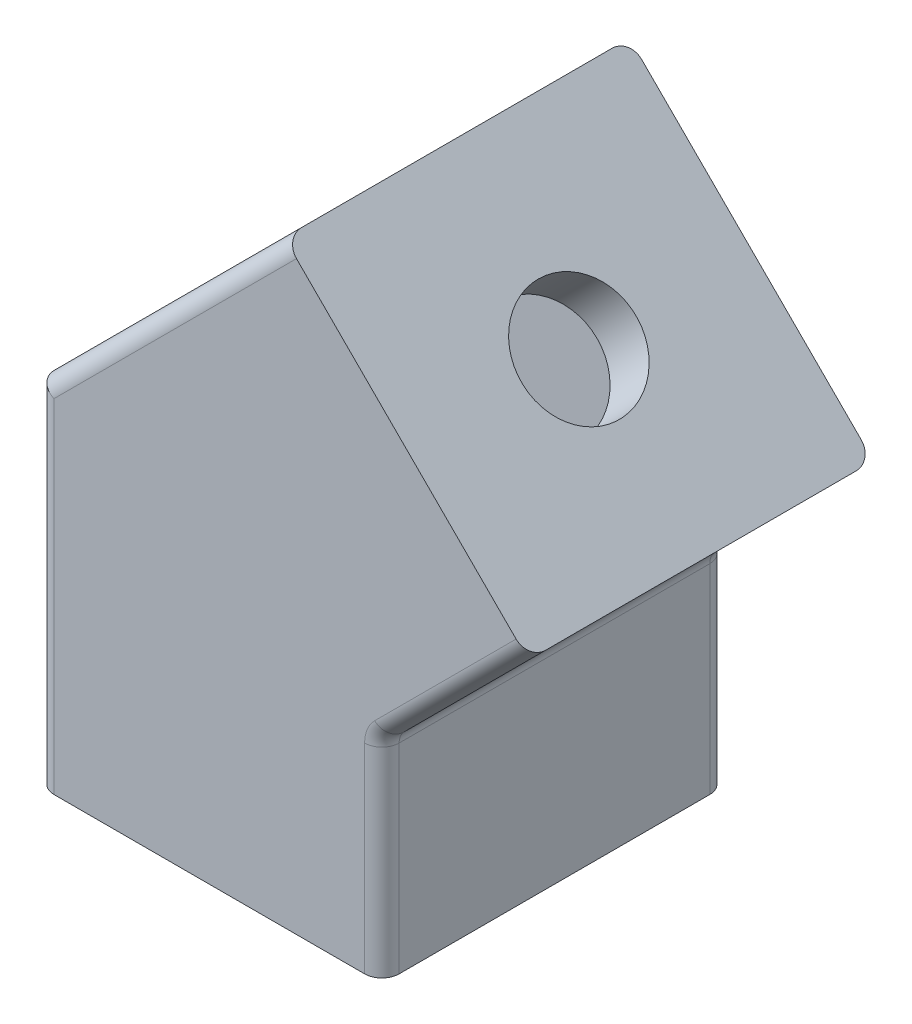
ISO-10303-21;
HEADER;
FILE_DESCRIPTION(('STEP AP214'),'2;1');
FILE_NAME('part.step','',(''),(''),'','','');
FILE_SCHEMA(('AUTOMOTIVE_DESIGN { 1 0 10303 214 1 1 1 1 }'));
ENDSEC;
DATA;
#1=APPLICATION_CONTEXT('core data for automotive mechanical design processes');
#2=APPLICATION_PROTOCOL_DEFINITION('international standard','automotive_design',2000,#1);
#3=PRODUCT_CONTEXT('',#1,'mechanical');
#4=PRODUCT('Part','Part','',(#3));
#5=PRODUCT_RELATED_PRODUCT_CATEGORY('part','',(#4));
#6=PRODUCT_DEFINITION_FORMATION('','',#4);
#7=PRODUCT_DEFINITION_CONTEXT('part definition',#1,'design');
#8=PRODUCT_DEFINITION('design','',#6,#7);
#9=PRODUCT_DEFINITION_SHAPE('','',#8);
#10=(LENGTH_UNIT() NAMED_UNIT(*) SI_UNIT(.MILLI.,.METRE.));
#11=(NAMED_UNIT(*) PLANE_ANGLE_UNIT() SI_UNIT($,.RADIAN.));
#12=(NAMED_UNIT(*) SI_UNIT($,.STERADIAN.) SOLID_ANGLE_UNIT());
#13=UNCERTAINTY_MEASURE_WITH_UNIT(LENGTH_MEASURE(1.E-05),#10,'distance_accuracy_value','');
#14=(GEOMETRIC_REPRESENTATION_CONTEXT(3) GLOBAL_UNCERTAINTY_ASSIGNED_CONTEXT((#13)) GLOBAL_UNIT_ASSIGNED_CONTEXT((#10,
#11,#12)) REPRESENTATION_CONTEXT('',''));
#15=CARTESIAN_POINT('',(0.,0.,0.));
#16=DIRECTION('',(0.,0.,1.));
#17=DIRECTION('',(1.,0.,0.));
#18=AXIS2_PLACEMENT_3D('',#15,#16,#17);
#19=CARTESIAN_POINT('',(-11.3137084989846,45.2548339959391,20.));
#20=DIRECTION('',(0.707106781186546,-0.707106781186549,0.));
#21=DIRECTION('',(0.707106781186549,0.707106781186546,0.));
#22=AXIS2_PLACEMENT_3D('',#19,#20,#21);
#23=PLANE('',#22);
#24=DIRECTION('',(0.,0.,-1.));
#25=VECTOR('',#24,1.);
#26=CARTESIAN_POINT('',(-40.,16.5685424949239,20.));
#27=LINE('',#26,#25);
#28=CARTESIAN_POINT('',(-40.,16.5685424949239,18.));
#29=VERTEX_POINT('',#28);
#30=CARTESIAN_POINT('',(-40.,16.5685424949239,16.7));
#31=VERTEX_POINT('',#30);
#32=EDGE_CURVE('E256',#29,#31,#27,.T.);
#33=ORIENTED_EDGE('',*,*,#32,.F.);
#34=DIRECTION('',(-0.707106781186549,-0.707106781186546,0.));
#35=VECTOR('',#34,1.);
#36=CARTESIAN_POINT('',(-11.3137084989846,45.2548339959391,18.));
#37=LINE('',#36,#35);
#38=CARTESIAN_POINT('',(-11.3137084989846,45.2548339959391,18.));
#39=VERTEX_POINT('',#38);
#40=EDGE_CURVE('E310',#29,#39,#37,.F.);
#41=ORIENTED_EDGE('',*,*,#40,.T.);
#42=DIRECTION('',(0.,0.,-1.));
#43=VECTOR('',#42,1.);
#44=CARTESIAN_POINT('',(-11.3137084989846,45.2548339959391,20.));
#45=LINE('',#44,#43);
#46=CARTESIAN_POINT('',(-11.3137084989846,45.2548339959391,-18.));
#47=VERTEX_POINT('',#46);
#48=EDGE_CURVE('E258',#39,#47,#45,.T.);
#49=ORIENTED_EDGE('',*,*,#48,.T.);
#50=DIRECTION('',(-0.707106781186549,-0.707106781186546,0.));
#51=VECTOR('',#50,1.);
#52=CARTESIAN_POINT('',(-11.3137084989846,45.2548339959391,-18.));
#53=LINE('',#52,#51);
#54=CARTESIAN_POINT('',(-40.,16.5685424949239,-18.));
#55=VERTEX_POINT('',#54);
#56=EDGE_CURVE('E307',#47,#55,#53,.T.);
#57=ORIENTED_EDGE('',*,*,#56,.T.);
#58=CARTESIAN_POINT('',(-40.,16.5685424949239,-16.7));
#59=VERTEX_POINT('',#58);
#60=EDGE_CURVE('E255',#59,#55,#27,.T.);
#61=ORIENTED_EDGE('',*,*,#60,.F.);
#62=DIRECTION('',(-0.707106781186549,-0.707106781186546,0.));
#63=VECTOR('',#62,1.);
#64=CARTESIAN_POINT('',(-11.3137084989846,45.2548339959391,-16.7));
#65=LINE('',#64,#63);
#66=CARTESIAN_POINT('',(-15.8391918985786,40.7293505963452,-16.7));
#67=VERTEX_POINT('',#66);
#68=EDGE_CURVE('E227',#67,#59,#65,.T.);
#69=ORIENTED_EDGE('',*,*,#68,.F.);
#70=DIRECTION('',(0.,0.,-1.));
#71=VECTOR('',#70,1.);
#72=CARTESIAN_POINT('',(-15.8391918985786,40.7293505963452,20.));
#73=LINE('',#72,#71);
#74=CARTESIAN_POINT('',(-15.8391918985786,40.7293505963452,16.7));
#75=VERTEX_POINT('',#74);
#76=EDGE_CURVE('E223',#75,#67,#73,.T.);
#77=ORIENTED_EDGE('',*,*,#76,.F.);
#78=DIRECTION('',(-0.707106781186549,-0.707106781186546,0.));
#79=VECTOR('',#78,1.);
#80=CARTESIAN_POINT('',(-11.3137084989846,45.2548339959391,16.7));
#81=LINE('',#80,#79);
#82=EDGE_CURVE('E229',#75,#31,#81,.T.);
#83=ORIENTED_EDGE('',*,*,#82,.T.);
#84=EDGE_LOOP('',(#33,#41,#49,#57,#61,#69,#77,#83));
#85=FACE_BOUND('',#84,.T.);
#86=ADVANCED_FACE('F39',(#85),#23,.F.);
#87=CARTESIAN_POINT('',(-40.,16.5685424949239,20.));
#88=DIRECTION('',(1.,0.,0.));
#89=DIRECTION('',(0.,0.,-1.));
#90=AXIS2_PLACEMENT_3D('',#87,#88,#89);
#91=PLANE('',#90);
#92=DIRECTION('',(0.,0.,-1.));
#93=VECTOR('',#92,1.);
#94=CARTESIAN_POINT('',(-40.,-24.,20.));
#95=LINE('',#94,#93);
#96=CARTESIAN_POINT('',(-40.,-24.,18.));
#97=VERTEX_POINT('',#96);
#98=CARTESIAN_POINT('',(-40.,-24.,-18.));
#99=VERTEX_POINT('',#98);
#100=EDGE_CURVE('E248',#97,#99,#95,.T.);
#101=ORIENTED_EDGE('',*,*,#100,.F.);
#102=DIRECTION('',(0.,-1.,0.));
#103=VECTOR('',#102,1.);
#104=CARTESIAN_POINT('',(-40.,16.5685424949239,18.));
#105=LINE('',#104,#103);
#106=EDGE_CURVE('E322',#97,#29,#105,.F.);
#107=ORIENTED_EDGE('',*,*,#106,.T.);
#108=ORIENTED_EDGE('',*,*,#32,.T.);
#109=DIRECTION('',(0.,-1.,0.));
#110=VECTOR('',#109,1.);
#111=CARTESIAN_POINT('',(-40.,16.5685424949239,16.7));
#112=LINE('',#111,#110);
#113=CARTESIAN_POINT('',(-40.,-14.,16.7));
#114=VERTEX_POINT('',#113);
#115=EDGE_CURVE('E232',#31,#114,#112,.T.);
#116=ORIENTED_EDGE('',*,*,#115,.T.);
#117=DIRECTION('',(0.,0.,-1.));
#118=VECTOR('',#117,1.);
#119=CARTESIAN_POINT('',(-40.,-14.,20.));
#120=LINE('',#119,#118);
#121=CARTESIAN_POINT('',(-40.,-14.,-16.7));
#122=VERTEX_POINT('',#121);
#123=EDGE_CURVE('E230',#114,#122,#120,.T.);
#124=ORIENTED_EDGE('',*,*,#123,.T.);
#125=DIRECTION('',(0.,-1.,0.));
#126=VECTOR('',#125,1.);
#127=CARTESIAN_POINT('',(-40.,16.5685424949239,-16.7));
#128=LINE('',#127,#126);
#129=EDGE_CURVE('E207',#59,#122,#128,.T.);
#130=ORIENTED_EDGE('',*,*,#129,.F.);
#131=ORIENTED_EDGE('',*,*,#60,.T.);
#132=DIRECTION('',(0.,-1.,0.));
#133=VECTOR('',#132,1.);
#134=CARTESIAN_POINT('',(-40.,16.5685424949239,-18.));
#135=LINE('',#134,#133);
#136=EDGE_CURVE('E320',#55,#99,#135,.T.);
#137=ORIENTED_EDGE('',*,*,#136,.T.);
#138=EDGE_LOOP('',(#101,#107,#108,#116,#124,#130,#131,#137));
#139=FACE_BOUND('',#138,.T.);
#140=ADVANCED_FACE('F371',(#139),#91,.F.);
#141=CARTESIAN_POINT('',(-40.,-24.,20.));
#142=DIRECTION('',(0.,1.,0.));
#143=DIRECTION('',(0.,0.,1.));
#144=AXIS2_PLACEMENT_3D('',#141,#142,#143);
#145=PLANE('',#144);
#146=CARTESIAN_POINT('',(-20.,-24.,0.));
#147=DIRECTION('',(0.,-1.,0.));
#148=DIRECTION('',(0.,0.,-1.));
#149=AXIS2_PLACEMENT_3D('',#146,#147,#148);
#150=CIRCLE('',#149,6.65);
#151=CARTESIAN_POINT('',(-20.,-24.,-6.65));
#152=VERTEX_POINT('',#151);
#153=EDGE_CURVE('E208',#152,#152,#150,.T.);
#154=ORIENTED_EDGE('',*,*,#153,.F.);
#155=EDGE_LOOP('',(#154));
#156=FACE_BOUND('',#155,.T.);
#157=DIRECTION('',(1.,0.,0.));
#158=VECTOR('',#157,1.);
#159=CARTESIAN_POINT('',(-40.,-24.,20.));
#160=LINE('',#159,#158);
#161=CARTESIAN_POINT('',(-38.,-24.,20.));
#162=VERTEX_POINT('',#161);
#163=CARTESIAN_POINT('',(-2.,-24.,20.));
#164=VERTEX_POINT('',#163);
#165=EDGE_CURVE('E241',#162,#164,#160,.T.);
#166=ORIENTED_EDGE('',*,*,#165,.F.);
#167=CARTESIAN_POINT('',(-38.,-24.,18.));
#168=DIRECTION('',(0.,1.,0.));
#169=DIRECTION('',(0.,0.,1.));
#170=AXIS2_PLACEMENT_3D('',#167,#168,#169);
#171=CIRCLE('',#170,2.);
#172=EDGE_CURVE('E318',#162,#97,#171,.F.);
#173=ORIENTED_EDGE('',*,*,#172,.T.);
#174=ORIENTED_EDGE('',*,*,#100,.T.);
#175=CARTESIAN_POINT('',(-38.,-24.,-18.));
#176=DIRECTION('',(0.,1.,0.));
#177=DIRECTION('',(0.,0.,1.));
#178=AXIS2_PLACEMENT_3D('',#175,#176,#177);
#179=CIRCLE('',#178,2.);
#180=CARTESIAN_POINT('',(-38.,-24.,-20.));
#181=VERTEX_POINT('',#180);
#182=EDGE_CURVE('E316',#99,#181,#179,.F.);
#183=ORIENTED_EDGE('',*,*,#182,.T.);
#184=DIRECTION('',(1.,0.,0.));
#185=VECTOR('',#184,1.);
#186=CARTESIAN_POINT('',(-40.,-24.,-20.));
#187=LINE('',#186,#185);
#188=CARTESIAN_POINT('',(-2.,-24.,-20.));
#189=VERTEX_POINT('',#188);
#190=EDGE_CURVE('E202',#181,#189,#187,.T.);
#191=ORIENTED_EDGE('',*,*,#190,.T.);
#192=CARTESIAN_POINT('',(-2.,-24.,-18.));
#193=DIRECTION('',(0.,1.,0.));
#194=DIRECTION('',(0.,0.,1.));
#195=AXIS2_PLACEMENT_3D('',#192,#193,#194);
#196=CIRCLE('',#195,2.);
#197=CARTESIAN_POINT('',(0.,-24.,-18.));
#198=VERTEX_POINT('',#197);
#199=EDGE_CURVE('E314',#189,#198,#196,.F.);
#200=ORIENTED_EDGE('',*,*,#199,.T.);
#201=DIRECTION('',(0.,0.,-1.));
#202=VECTOR('',#201,1.);
#203=CARTESIAN_POINT('',(0.,-24.,20.));
#204=LINE('',#203,#202);
#205=CARTESIAN_POINT('',(0.,-24.,18.));
#206=VERTEX_POINT('',#205);
#207=EDGE_CURVE('E264',#206,#198,#204,.T.);
#208=ORIENTED_EDGE('',*,*,#207,.F.);
#209=CARTESIAN_POINT('',(-2.,-24.,18.));
#210=DIRECTION('',(0.,1.,0.));
#211=DIRECTION('',(0.,0.,1.));
#212=AXIS2_PLACEMENT_3D('',#209,#210,#211);
#213=CIRCLE('',#212,2.);
#214=EDGE_CURVE('E312',#206,#164,#213,.F.);
#215=ORIENTED_EDGE('',*,*,#214,.T.);
#216=EDGE_LOOP('',(#166,#173,#174,#183,#191,#200,#208,#215));
#217=FACE_BOUND('',#216,.T.);
#218=ADVANCED_FACE('F406',(#156,#217),#145,.F.);
#219=CARTESIAN_POINT('',(0.,-24.,20.));
#220=DIRECTION('',(-1.,0.,0.));
#221=DIRECTION('',(0.,0.,1.));
#222=AXIS2_PLACEMENT_3D('',#219,#220,#221);
#223=PLANE('',#222);
#224=ORIENTED_EDGE('',*,*,#207,.T.);
#225=DIRECTION('',(0.,1.,0.));
#226=VECTOR('',#225,1.);
#227=CARTESIAN_POINT('',(0.,-24.,-18.));
#228=LINE('',#227,#226);
#229=CARTESIAN_POINT('',(0.,-0.828427124746193,-18.));
#230=VERTEX_POINT('',#229);
#231=EDGE_CURVE('E56',#198,#230,#228,.T.);
#232=ORIENTED_EDGE('',*,*,#231,.T.);
#233=DIRECTION('',(0.,0.,-1.));
#234=VECTOR('',#233,1.);
#235=CARTESIAN_POINT('',(0.,-0.828427124746193,20.));
#236=LINE('',#235,#234);
#237=CARTESIAN_POINT('',(0.,-0.828427124746193,18.));
#238=VERTEX_POINT('',#237);
#239=EDGE_CURVE('E60',#230,#238,#236,.F.);
#240=ORIENTED_EDGE('',*,*,#239,.T.);
#241=DIRECTION('',(0.,1.,0.));
#242=VECTOR('',#241,1.);
#243=CARTESIAN_POINT('',(0.,-24.,18.));
#244=LINE('',#243,#242);
#245=EDGE_CURVE('E324',#238,#206,#244,.F.);
#246=ORIENTED_EDGE('',*,*,#245,.T.);
#247=EDGE_LOOP('',(#224,#232,#240,#246));
#248=FACE_BOUND('',#247,.T.);
#249=ADVANCED_FACE('F418',(#248),#223,.F.);
#250=CARTESIAN_POINT('',(0.,0.,20.));
#251=DIRECTION('',(-0.707106781186545,0.70710678118655,0.));
#252=DIRECTION('',(-0.70710678118655,-0.707106781186545,0.));
#253=AXIS2_PLACEMENT_3D('',#250,#251,#252);
#254=PLANE('',#253);
#255=DIRECTION('',(0.,0.,-1.));
#256=VECTOR('',#255,1.);
#257=CARTESIAN_POINT('',(0.58578643762691,0.585786437626906,-20.));
#258=LINE('',#257,#256);
#259=CARTESIAN_POINT('',(0.585786437626909,0.585786437626906,18.));
#260=VERTEX_POINT('',#259);
#261=CARTESIAN_POINT('',(0.585786437626909,0.585786437626906,-18.));
#262=VERTEX_POINT('',#261);
#263=EDGE_CURVE('E268',#260,#262,#258,.T.);
#264=ORIENTED_EDGE('',*,*,#263,.T.);
#265=DIRECTION('',(0.70710678118655,0.707106781186545,0.));
#266=VECTOR('',#265,1.);
#267=CARTESIAN_POINT('',(0.,0.,-18.));
#268=LINE('',#267,#266);
#269=CARTESIAN_POINT('',(16.9705627484772,16.9705627484771,-18.));
#270=VERTEX_POINT('',#269);
#271=EDGE_CURVE('E270',#262,#270,#268,.T.);
#272=ORIENTED_EDGE('',*,*,#271,.T.);
#273=DIRECTION('',(0.,0.,-1.));
#274=VECTOR('',#273,1.);
#275=CARTESIAN_POINT('',(16.9705627484772,16.9705627484771,20.));
#276=LINE('',#275,#274);
#277=CARTESIAN_POINT('',(16.9705627484772,16.9705627484771,18.));
#278=VERTEX_POINT('',#277);
#279=EDGE_CURVE('E261',#278,#270,#276,.T.);
#280=ORIENTED_EDGE('',*,*,#279,.F.);
#281=DIRECTION('',(0.70710678118655,0.707106781186545,0.));
#282=VECTOR('',#281,1.);
#283=CARTESIAN_POINT('',(0.,0.,18.));
#284=LINE('',#283,#282);
#285=EDGE_CURVE('E266',#278,#260,#284,.F.);
#286=ORIENTED_EDGE('',*,*,#285,.T.);
#287=EDGE_LOOP('',(#264,#272,#280,#286));
#288=FACE_BOUND('',#287,.T.);
#289=ADVANCED_FACE('F414',(#288),#254,.F.);
#290=CARTESIAN_POINT('',(16.9705627484772,16.9705627484771,20.));
#291=DIRECTION('',(-0.707106781186549,-0.707106781186546,0.));
#292=DIRECTION('',(0.707106781186546,-0.707106781186549,0.));
#293=AXIS2_PLACEMENT_3D('',#290,#291,#292);
#294=PLANE('',#293);
#295=CARTESIAN_POINT('',(2.82842712474628,31.1126983722081,0.));
#296=DIRECTION('',(0.707106781186549,0.707106781186546,0.));
#297=DIRECTION('',(-0.707106781186546,0.707106781186549,0.));
#298=AXIS2_PLACEMENT_3D('',#295,#296,#297);
#299=CIRCLE('',#298,6.65);
#300=CARTESIAN_POINT('',(-1.87383297014426,35.8149584670986,0.));
#301=VERTEX_POINT('',#300);
#302=EDGE_CURVE('E620',#301,#301,#299,.T.);
#303=ORIENTED_EDGE('',*,*,#302,.F.);
#304=EDGE_LOOP('',(#303));
#305=FACE_BOUND('',#304,.T.);
#306=ORIENTED_EDGE('',*,*,#279,.T.);
#307=CARTESIAN_POINT('',(15.5563491861041,18.3847763108502,-18.));
#308=DIRECTION('',(-0.707106781186549,-0.707106781186546,0.));
#309=DIRECTION('',(0.707106781186546,-0.707106781186549,0.));
#310=AXIS2_PLACEMENT_3D('',#307,#308,#309);
#311=CIRCLE('',#310,2.);
#312=CARTESIAN_POINT('',(15.5563491861041,18.3847763108502,-20.));
#313=VERTEX_POINT('',#312);
#314=EDGE_CURVE('E279',#270,#313,#311,.F.);
#315=ORIENTED_EDGE('',*,*,#314,.T.);
#316=DIRECTION('',(-0.707106781186546,0.707106781186549,0.));
#317=VECTOR('',#316,1.);
#318=CARTESIAN_POINT('',(16.9705627484772,16.9705627484771,-20.));
#319=LINE('',#318,#317);
#320=CARTESIAN_POINT('',(-9.89949493661156,43.840620433566,-20.));
#321=VERTEX_POINT('',#320);
#322=EDGE_CURVE('E245',#313,#321,#319,.T.);
#323=ORIENTED_EDGE('',*,*,#322,.T.);
#324=CARTESIAN_POINT('',(-9.89949493661156,43.840620433566,-18.));
#325=DIRECTION('',(-0.707106781186549,-0.707106781186546,0.));
#326=DIRECTION('',(0.707106781186546,-0.707106781186549,0.));
#327=AXIS2_PLACEMENT_3D('',#324,#325,#326);
#328=CIRCLE('',#327,2.);
#329=EDGE_CURVE('E275',#321,#47,#328,.F.);
#330=ORIENTED_EDGE('',*,*,#329,.T.);
#331=ORIENTED_EDGE('',*,*,#48,.F.);
#332=CARTESIAN_POINT('',(-9.89949493661156,43.840620433566,18.));
#333=DIRECTION('',(-0.707106781186549,-0.707106781186546,0.));
#334=DIRECTION('',(0.707106781186546,-0.707106781186549,0.));
#335=AXIS2_PLACEMENT_3D('',#332,#333,#334);
#336=CIRCLE('',#335,2.);
#337=CARTESIAN_POINT('',(-9.89949493661156,43.840620433566,20.));
#338=VERTEX_POINT('',#337);
#339=EDGE_CURVE('E277',#39,#338,#336,.F.);
#340=ORIENTED_EDGE('',*,*,#339,.T.);
#341=DIRECTION('',(-0.707106781186546,0.707106781186549,0.));
#342=VECTOR('',#341,1.);
#343=CARTESIAN_POINT('',(16.9705627484772,16.9705627484771,20.));
#344=LINE('',#343,#342);
#345=CARTESIAN_POINT('',(15.5563491861041,18.3847763108502,20.));
#346=VERTEX_POINT('',#345);
#347=EDGE_CURVE('E244',#346,#338,#344,.T.);
#348=ORIENTED_EDGE('',*,*,#347,.F.);
#349=CARTESIAN_POINT('',(15.5563491861041,18.3847763108502,18.));
#350=DIRECTION('',(-0.707106781186549,-0.707106781186546,0.));
#351=DIRECTION('',(0.707106781186546,-0.707106781186549,0.));
#352=AXIS2_PLACEMENT_3D('',#349,#350,#351);
#353=CIRCLE('',#352,2.);
#354=EDGE_CURVE('E273',#346,#278,#353,.F.);
#355=ORIENTED_EDGE('',*,*,#354,.T.);
#356=EDGE_LOOP('',(#306,#315,#323,#330,#331,#340,#348,#355));
#357=FACE_BOUND('',#356,.T.);
#358=ADVANCED_FACE('F410',(#305,#357),#294,.F.);
#359=CARTESIAN_POINT('',(0.,0.,20.));
#360=DIRECTION('',(0.,0.,1.));
#361=DIRECTION('',(1.,0.,0.));
#362=AXIS2_PLACEMENT_3D('',#359,#360,#361);
#363=PLANE('',#362);
#364=ORIENTED_EDGE('',*,*,#347,.T.);
#365=DIRECTION('',(-0.707106781186549,-0.707106781186546,0.));
#366=VECTOR('',#365,1.);
#367=CARTESIAN_POINT('',(-38.5857864376269,15.1543289325508,20.));
#368=LINE('',#367,#366);
#369=CARTESIAN_POINT('',(-38.,15.7401153701777,20.));
#370=VERTEX_POINT('',#369);
#371=EDGE_CURVE('E304',#338,#370,#368,.T.);
#372=ORIENTED_EDGE('',*,*,#371,.T.);
#373=DIRECTION('',(0.,-1.,0.));
#374=VECTOR('',#373,1.);
#375=CARTESIAN_POINT('',(-38.,-24.,20.));
#376=LINE('',#375,#374);
#377=EDGE_CURVE('E302',#370,#162,#376,.T.);
#378=ORIENTED_EDGE('',*,*,#377,.T.);
#379=ORIENTED_EDGE('',*,*,#165,.T.);
#380=DIRECTION('',(0.,1.,0.));
#381=VECTOR('',#380,1.);
#382=CARTESIAN_POINT('',(-2.,0.,20.));
#383=LINE('',#382,#381);
#384=CARTESIAN_POINT('',(-2.,-0.828427124746193,20.));
#385=VERTEX_POINT('',#384);
#386=EDGE_CURVE('E300',#164,#385,#383,.T.);
#387=ORIENTED_EDGE('',*,*,#386,.T.);
#388=CARTESIAN_POINT('',(2.,-0.828427124746193,20.));
#389=DIRECTION('',(0.,0.,1.));
#390=DIRECTION('',(1.,0.,0.));
#391=AXIS2_PLACEMENT_3D('',#388,#389,#390);
#392=CIRCLE('',#391,4.);
#393=CARTESIAN_POINT('',(-0.828427124746182,2.00000000000001,20.));
#394=VERTEX_POINT('',#393);
#395=EDGE_CURVE('E297',#394,#385,#392,.T.);
#396=ORIENTED_EDGE('',*,*,#395,.F.);
#397=DIRECTION('',(0.70710678118655,0.707106781186545,0.));
#398=VECTOR('',#397,1.);
#399=CARTESIAN_POINT('',(15.5563491861041,18.3847763108502,20.));
#400=LINE('',#399,#398);
#401=EDGE_CURVE('E295',#394,#346,#400,.T.);
#402=ORIENTED_EDGE('',*,*,#401,.T.);
#403=EDGE_LOOP('',(#364,#372,#378,#379,#387,#396,#402));
#404=FACE_BOUND('',#403,.T.);
#405=ADVANCED_FACE('F413',(#404),#363,.T.);
#406=CARTESIAN_POINT('',(0.,0.,-20.));
#407=DIRECTION('',(0.,0.,1.));
#408=DIRECTION('',(1.,0.,0.));
#409=AXIS2_PLACEMENT_3D('',#406,#407,#408);
#410=PLANE('',#409);
#411=DIRECTION('',(0.,-1.,0.));
#412=VECTOR('',#411,1.);
#413=CARTESIAN_POINT('',(-38.,0.,-20.));
#414=LINE('',#413,#412);
#415=CARTESIAN_POINT('',(-38.,15.7401153701777,-20.));
#416=VERTEX_POINT('',#415);
#417=EDGE_CURVE('E288',#181,#416,#414,.F.);
#418=ORIENTED_EDGE('',*,*,#417,.T.);
#419=DIRECTION('',(-0.707106781186549,-0.707106781186546,0.));
#420=VECTOR('',#419,1.);
#421=CARTESIAN_POINT('',(-26.8700576850887,26.8700576850889,-20.));
#422=LINE('',#421,#420);
#423=EDGE_CURVE('E290',#416,#321,#422,.F.);
#424=ORIENTED_EDGE('',*,*,#423,.T.);
#425=ORIENTED_EDGE('',*,*,#322,.F.);
#426=DIRECTION('',(0.70710678118655,0.707106781186545,0.));
#427=VECTOR('',#426,1.);
#428=CARTESIAN_POINT('',(-1.41421356237309,1.4142135623731,-20.));
#429=LINE('',#428,#427);
#430=CARTESIAN_POINT('',(-0.828427124746181,2.,-20.));
#431=VERTEX_POINT('',#430);
#432=EDGE_CURVE('E286',#313,#431,#429,.F.);
#433=ORIENTED_EDGE('',*,*,#432,.T.);
#434=CARTESIAN_POINT('',(2.,-0.828427124746193,-20.));
#435=DIRECTION('',(0.,0.,1.));
#436=DIRECTION('',(1.,0.,0.));
#437=AXIS2_PLACEMENT_3D('',#434,#435,#436);
#438=CIRCLE('',#437,4.);
#439=CARTESIAN_POINT('',(-2.,-0.828427124746193,-20.));
#440=VERTEX_POINT('',#439);
#441=EDGE_CURVE('E283',#440,#431,#438,.F.);
#442=ORIENTED_EDGE('',*,*,#441,.F.);
#443=DIRECTION('',(0.,1.,0.));
#444=VECTOR('',#443,1.);
#445=CARTESIAN_POINT('',(-2.,0.,-20.));
#446=LINE('',#445,#444);
#447=EDGE_CURVE('E281',#440,#189,#446,.F.);
#448=ORIENTED_EDGE('',*,*,#447,.T.);
#449=ORIENTED_EDGE('',*,*,#190,.F.);
#450=EDGE_LOOP('',(#418,#424,#425,#433,#442,#448,#449));
#451=FACE_BOUND('',#450,.T.);
#452=ADVANCED_FACE('F540',(#451),#410,.F.);
#453=CARTESIAN_POINT('',(-40.,-14.,20.));
#454=DIRECTION('',(0.,1.,0.));
#455=DIRECTION('',(0.,0.,1.));
#456=AXIS2_PLACEMENT_3D('',#453,#454,#455);
#457=PLANE('',#456);
#458=CARTESIAN_POINT('',(-20.,-14.,0.));
#459=DIRECTION('',(0.,1.,0.));
#460=DIRECTION('',(0.,0.,1.));
#461=AXIS2_PLACEMENT_3D('',#458,#459,#460);
#462=CIRCLE('',#461,6.65);
#463=CARTESIAN_POINT('',(-20.,-14.,6.65));
#464=VERTEX_POINT('',#463);
#465=EDGE_CURVE('E211',#464,#464,#462,.F.);
#466=ORIENTED_EDGE('',*,*,#465,.T.);
#467=EDGE_LOOP('',(#466));
#468=FACE_BOUND('',#467,.T.);
#469=DIRECTION('',(1.,0.,0.));
#470=VECTOR('',#469,1.);
#471=CARTESIAN_POINT('',(-40.,-14.,-16.7));
#472=LINE('',#471,#470);
#473=CARTESIAN_POINT('',(-3.3,-14.,-16.7));
#474=VERTEX_POINT('',#473);
#475=EDGE_CURVE('E193',#122,#474,#472,.T.);
#476=ORIENTED_EDGE('',*,*,#475,.F.);
#477=ORIENTED_EDGE('',*,*,#123,.F.);
#478=DIRECTION('',(1.,0.,0.));
#479=VECTOR('',#478,1.);
#480=CARTESIAN_POINT('',(-40.,-14.,16.7));
#481=LINE('',#480,#479);
#482=CARTESIAN_POINT('',(-3.3,-14.,16.7));
#483=VERTEX_POINT('',#482);
#484=EDGE_CURVE('E201',#114,#483,#481,.T.);
#485=ORIENTED_EDGE('',*,*,#484,.T.);
#486=DIRECTION('',(0.,0.,-1.));
#487=VECTOR('',#486,1.);
#488=CARTESIAN_POINT('',(-3.3,-14.,20.));
#489=LINE('',#488,#487);
#490=EDGE_CURVE('E187',#483,#474,#489,.T.);
#491=ORIENTED_EDGE('',*,*,#490,.T.);
#492=EDGE_LOOP('',(#476,#477,#485,#491));
#493=FACE_BOUND('',#492,.T.);
#494=ADVANCED_FACE('F198',(#468,#493),#457,.T.);
#495=CARTESIAN_POINT('',(-3.3,-24.,20.));
#496=DIRECTION('',(-1.,0.,0.));
#497=DIRECTION('',(0.,0.,1.));
#498=AXIS2_PLACEMENT_3D('',#495,#496,#497);
#499=PLANE('',#498);
#500=DIRECTION('',(0.,1.,0.));
#501=VECTOR('',#500,1.);
#502=CARTESIAN_POINT('',(-3.3,-24.,16.7));
#503=LINE('',#502,#501);
#504=CARTESIAN_POINT('',(-3.3,0.538477631085024,16.7));
#505=VERTEX_POINT('',#504);
#506=EDGE_CURVE('E215',#483,#505,#503,.T.);
#507=ORIENTED_EDGE('',*,*,#506,.T.);
#508=DIRECTION('',(0.,0.,-1.));
#509=VECTOR('',#508,1.);
#510=CARTESIAN_POINT('',(-3.3,0.538477631085024,20.));
#511=LINE('',#510,#509);
#512=CARTESIAN_POINT('',(-3.3,0.538477631085024,-16.7));
#513=VERTEX_POINT('',#512);
#514=EDGE_CURVE('E189',#505,#513,#511,.T.);
#515=ORIENTED_EDGE('',*,*,#514,.T.);
#516=DIRECTION('',(0.,1.,0.));
#517=VECTOR('',#516,1.);
#518=CARTESIAN_POINT('',(-3.3,-24.,-16.7));
#519=LINE('',#518,#517);
#520=EDGE_CURVE('E183',#474,#513,#519,.T.);
#521=ORIENTED_EDGE('',*,*,#520,.F.);
#522=ORIENTED_EDGE('',*,*,#490,.F.);
#523=EDGE_LOOP('',(#507,#515,#521,#522));
#524=FACE_BOUND('',#523,.T.);
#525=ADVANCED_FACE('F186',(#524),#499,.T.);
#526=CARTESIAN_POINT('',(-2.3334523779156,2.33345237791561,20.));
#527=DIRECTION('',(-0.707106781186545,0.70710678118655,0.));
#528=DIRECTION('',(-0.70710678118655,-0.707106781186545,0.));
#529=AXIS2_PLACEMENT_3D('',#526,#527,#528);
#530=PLANE('',#529);
#531=DIRECTION('',(0.70710678118655,0.707106781186545,0.));
#532=VECTOR('',#531,1.);
#533=CARTESIAN_POINT('',(-2.3334523779156,2.33345237791561,-16.7));
#534=LINE('',#533,#532);
#535=CARTESIAN_POINT('',(-2.71421356237309,1.95269119345812,-16.7));
#536=VERTEX_POINT('',#535);
#537=CARTESIAN_POINT('',(10.1116269709677,14.7785317267988,-16.7));
#538=VERTEX_POINT('',#537);
#539=EDGE_CURVE('E192',#536,#538,#534,.T.);
#540=ORIENTED_EDGE('',*,*,#539,.F.);
#541=DIRECTION('',(0.,0.,-1.));
#542=VECTOR('',#541,1.);
#543=CARTESIAN_POINT('',(-2.71421356237309,1.95269119345812,20.));
#544=LINE('',#543,#542);
#545=CARTESIAN_POINT('',(-2.71421356237309,1.95269119345812,16.7));
#546=VERTEX_POINT('',#545);
#547=EDGE_CURVE('E293',#536,#546,#544,.F.);
#548=ORIENTED_EDGE('',*,*,#547,.T.);
#549=DIRECTION('',(0.70710678118655,0.707106781186545,0.));
#550=VECTOR('',#549,1.);
#551=CARTESIAN_POINT('',(-2.3334523779156,2.33345237791561,16.7));
#552=LINE('',#551,#550);
#553=CARTESIAN_POINT('',(10.1116269709677,14.7785317267988,16.7));
#554=VERTEX_POINT('',#553);
#555=EDGE_CURVE('E218',#546,#554,#552,.T.);
#556=ORIENTED_EDGE('',*,*,#555,.T.);
#557=DIRECTION('',(0.,0.,-1.));
#558=VECTOR('',#557,1.);
#559=CARTESIAN_POINT('',(10.1116269709677,14.7785317267988,20.));
#560=LINE('',#559,#558);
#561=EDGE_CURVE('E203',#554,#538,#560,.T.);
#562=ORIENTED_EDGE('',*,*,#561,.T.);
#563=EDGE_LOOP('',(#540,#548,#556,#562));
#564=FACE_BOUND('',#563,.T.);
#565=ADVANCED_FACE('F389',(#564),#530,.T.);
#566=CARTESIAN_POINT('',(12.4450793488833,12.4450793488832,20.));
#567=DIRECTION('',(-0.707106781186549,-0.707106781186546,0.));
#568=DIRECTION('',(0.707106781186546,-0.707106781186549,0.));
#569=AXIS2_PLACEMENT_3D('',#566,#567,#568);
#570=PLANE('',#569);
#571=CARTESIAN_POINT('',(-1.69705627484764,26.5872149726142,0.));
#572=DIRECTION('',(-0.707106781186549,-0.707106781186546,0.));
#573=DIRECTION('',(0.707106781186546,-0.707106781186549,0.));
#574=AXIS2_PLACEMENT_3D('',#571,#572,#573);
#575=CIRCLE('',#574,6.65);
#576=CARTESIAN_POINT('',(3.00520382004289,21.8849548777236,0.));
#577=VERTEX_POINT('',#576);
#578=EDGE_CURVE('E347',#577,#577,#575,.F.);
#579=ORIENTED_EDGE('',*,*,#578,.T.);
#580=EDGE_LOOP('',(#579));
#581=FACE_BOUND('',#580,.T.);
#582=DIRECTION('',(-0.707106781186546,0.707106781186549,0.));
#583=VECTOR('',#582,1.);
#584=CARTESIAN_POINT('',(12.4450793488833,12.4450793488832,-16.7));
#585=LINE('',#584,#583);
#586=EDGE_CURVE('E220',#538,#67,#585,.T.);
#587=ORIENTED_EDGE('',*,*,#586,.F.);
#588=ORIENTED_EDGE('',*,*,#561,.F.);
#589=DIRECTION('',(-0.707106781186546,0.707106781186549,0.));
#590=VECTOR('',#589,1.);
#591=CARTESIAN_POINT('',(12.4450793488833,12.4450793488832,16.7));
#592=LINE('',#591,#590);
#593=EDGE_CURVE('E225',#554,#75,#592,.T.);
#594=ORIENTED_EDGE('',*,*,#593,.T.);
#595=ORIENTED_EDGE('',*,*,#76,.T.);
#596=EDGE_LOOP('',(#587,#588,#594,#595));
#597=FACE_BOUND('',#596,.T.);
#598=ADVANCED_FACE('F380',(#581,#597),#570,.T.);
#599=CARTESIAN_POINT('',(0.,0.,16.7));
#600=DIRECTION('',(0.,0.,1.));
#601=DIRECTION('',(1.,0.,0.));
#602=AXIS2_PLACEMENT_3D('',#599,#600,#601);
#603=PLANE('',#602);
#604=ORIENTED_EDGE('',*,*,#484,.F.);
#605=ORIENTED_EDGE('',*,*,#115,.F.);
#606=ORIENTED_EDGE('',*,*,#82,.F.);
#607=ORIENTED_EDGE('',*,*,#593,.F.);
#608=ORIENTED_EDGE('',*,*,#555,.F.);
#609=CARTESIAN_POINT('',(-1.3,0.538477631085024,16.7));
#610=DIRECTION('',(0.,0.,1.));
#611=DIRECTION('',(1.,0.,0.));
#612=AXIS2_PLACEMENT_3D('',#609,#610,#611);
#613=CIRCLE('',#612,2.);
#614=EDGE_CURVE('E11',#546,#505,#613,.T.);
#615=ORIENTED_EDGE('',*,*,#614,.T.);
#616=ORIENTED_EDGE('',*,*,#506,.F.);
#617=EDGE_LOOP('',(#604,#605,#606,#607,#608,#615,#616));
#618=FACE_BOUND('',#617,.T.);
#619=ADVANCED_FACE('F375',(#618),#603,.F.);
#620=CARTESIAN_POINT('',(0.,0.,-16.7));
#621=DIRECTION('',(0.,0.,1.));
#622=DIRECTION('',(1.,0.,0.));
#623=AXIS2_PLACEMENT_3D('',#620,#621,#622);
#624=PLANE('',#623);
#625=ORIENTED_EDGE('',*,*,#475,.T.);
#626=ORIENTED_EDGE('',*,*,#520,.T.);
#627=CARTESIAN_POINT('',(-1.3,0.538477631085024,-16.7));
#628=DIRECTION('',(0.,0.,1.));
#629=DIRECTION('',(1.,0.,0.));
#630=AXIS2_PLACEMENT_3D('',#627,#628,#629);
#631=CIRCLE('',#630,2.);
#632=EDGE_CURVE('E48',#513,#536,#631,.F.);
#633=ORIENTED_EDGE('',*,*,#632,.T.);
#634=ORIENTED_EDGE('',*,*,#539,.T.);
#635=ORIENTED_EDGE('',*,*,#586,.T.);
#636=ORIENTED_EDGE('',*,*,#68,.T.);
#637=ORIENTED_EDGE('',*,*,#129,.T.);
#638=EDGE_LOOP('',(#625,#626,#633,#634,#635,#636,#637));
#639=FACE_BOUND('',#638,.T.);
#640=ADVANCED_FACE('F205',(#639),#624,.T.);
#641=CARTESIAN_POINT('',(-20.,45.2558339959391,0.));
#642=DIRECTION('',(0.,-1.,0.));
#643=DIRECTION('',(0.,0.,-1.));
#644=AXIS2_PLACEMENT_3D('',#641,#642,#643);
#645=CYLINDRICAL_SURFACE('',#644,6.65);
#646=ORIENTED_EDGE('',*,*,#465,.F.);
#647=EDGE_LOOP('',(#646));
#648=FACE_BOUND('',#647,.T.);
#649=ORIENTED_EDGE('',*,*,#153,.T.);
#650=EDGE_LOOP('',(#649));
#651=FACE_BOUND('',#650,.T.);
#652=ADVANCED_FACE('F514',(#648,#651),#645,.F.);
#653=CARTESIAN_POINT('',(-46.143135623731,-17.858864376269,0.));
#654=DIRECTION('',(0.707106781186549,0.707106781186546,0.));
#655=DIRECTION('',(-0.707106781186546,0.707106781186549,0.));
#656=AXIS2_PLACEMENT_3D('',#653,#654,#655);
#657=CYLINDRICAL_SURFACE('',#656,6.65);
#658=ORIENTED_EDGE('',*,*,#578,.F.);
#659=EDGE_LOOP('',(#658));
#660=FACE_BOUND('',#659,.T.);
#661=ORIENTED_EDGE('',*,*,#302,.T.);
#662=EDGE_LOOP('',(#661));
#663=FACE_BOUND('',#662,.T.);
#664=ADVANCED_FACE('F452',(#660,#663),#657,.F.);
#665=CARTESIAN_POINT('',(-2.,0.,18.));
#666=DIRECTION('',(0.,-1.,0.));
#667=DIRECTION('',(0.,0.,-1.));
#668=AXIS2_PLACEMENT_3D('',#665,#666,#667);
#669=CYLINDRICAL_SURFACE('',#668,2.);
#670=ORIENTED_EDGE('',*,*,#214,.F.);
#671=ORIENTED_EDGE('',*,*,#245,.F.);
#672=CARTESIAN_POINT('',(-2.,-0.828427124746193,18.));
#673=DIRECTION('',(0.,1.,0.));
#674=DIRECTION('',(0.,0.,1.));
#675=AXIS2_PLACEMENT_3D('',#672,#673,#674);
#676=CIRCLE('',#675,2.);
#677=EDGE_CURVE('E345',#385,#238,#676,.T.);
#678=ORIENTED_EDGE('',*,*,#677,.F.);
#679=ORIENTED_EDGE('',*,*,#386,.F.);
#680=EDGE_LOOP('',(#670,#671,#678,#679));
#681=FACE_BOUND('',#680,.T.);
#682=ADVANCED_FACE('F448',(#681),#669,.T.);
#683=CARTESIAN_POINT('',(-1.41421356237309,1.4142135623731,18.));
#684=DIRECTION('',(-0.70710678118655,-0.707106781186545,0.));
#685=DIRECTION('',(0.707106781186545,-0.70710678118655,0.));
#686=AXIS2_PLACEMENT_3D('',#683,#684,#685);
#687=CYLINDRICAL_SURFACE('',#686,2.);
#688=ORIENTED_EDGE('',*,*,#354,.F.);
#689=ORIENTED_EDGE('',*,*,#401,.F.);
#690=CARTESIAN_POINT('',(-0.828427124746182,2.00000000000001,18.));
#691=DIRECTION('',(-0.70710678118655,-0.707106781186545,0.));
#692=DIRECTION('',(0.707106781186545,-0.70710678118655,0.));
#693=AXIS2_PLACEMENT_3D('',#690,#691,#692);
#694=CIRCLE('',#693,2.);
#695=EDGE_CURVE('E342',#260,#394,#694,.T.);
#696=ORIENTED_EDGE('',*,*,#695,.F.);
#697=ORIENTED_EDGE('',*,*,#285,.F.);
#698=EDGE_LOOP('',(#688,#689,#696,#697));
#699=FACE_BOUND('',#698,.T.);
#700=ADVANCED_FACE('F444',(#699),#687,.T.);
#701=CARTESIAN_POINT('',(2.,-0.828427124746193,18.));
#702=DIRECTION('',(0.,0.,1.));
#703=DIRECTION('',(1.,0.,0.));
#704=AXIS2_PLACEMENT_3D('',#701,#702,#703);
#705=TOROIDAL_SURFACE('',#704,4.,2.);
#706=ORIENTED_EDGE('',*,*,#395,.T.);
#707=ORIENTED_EDGE('',*,*,#677,.T.);
#708=CARTESIAN_POINT('',(2.,-0.828427124746193,18.));
#709=DIRECTION('',(0.,0.,1.));
#710=DIRECTION('',(1.,0.,0.));
#711=AXIS2_PLACEMENT_3D('',#708,#709,#710);
#712=CIRCLE('',#711,2.);
#713=EDGE_CURVE('E339',#260,#238,#712,.T.);
#714=ORIENTED_EDGE('',*,*,#713,.F.);
#715=ORIENTED_EDGE('',*,*,#695,.T.);
#716=EDGE_LOOP('',(#706,#707,#714,#715));
#717=FACE_BOUND('',#716,.T.);
#718=ADVANCED_FACE('F440',(#717),#705,.T.);
#719=CARTESIAN_POINT('',(-2.,-24.,-18.));
#720=DIRECTION('',(0.,1.,0.));
#721=DIRECTION('',(0.,0.,1.));
#722=AXIS2_PLACEMENT_3D('',#719,#720,#721);
#723=CYLINDRICAL_SURFACE('',#722,2.);
#724=ORIENTED_EDGE('',*,*,#199,.F.);
#725=ORIENTED_EDGE('',*,*,#447,.F.);
#726=CARTESIAN_POINT('',(-2.,-0.828427124746193,-18.));
#727=DIRECTION('',(0.,1.,0.));
#728=DIRECTION('',(0.,0.,1.));
#729=AXIS2_PLACEMENT_3D('',#726,#727,#728);
#730=CIRCLE('',#729,2.);
#731=EDGE_CURVE('E336',#230,#440,#730,.T.);
#732=ORIENTED_EDGE('',*,*,#731,.F.);
#733=ORIENTED_EDGE('',*,*,#231,.F.);
#734=EDGE_LOOP('',(#724,#725,#732,#733));
#735=FACE_BOUND('',#734,.T.);
#736=ADVANCED_FACE('F436',(#735),#723,.T.);
#737=CARTESIAN_POINT('',(2.,-0.828427124746193,20.));
#738=DIRECTION('',(0.,0.,1.));
#739=DIRECTION('',(1.,0.,0.));
#740=AXIS2_PLACEMENT_3D('',#737,#738,#739);
#741=CYLINDRICAL_SURFACE('',#740,2.);
#742=ORIENTED_EDGE('',*,*,#713,.T.);
#743=ORIENTED_EDGE('',*,*,#239,.F.);
#744=CARTESIAN_POINT('',(2.,-0.828427124746193,-18.));
#745=DIRECTION('',(0.,0.,1.));
#746=DIRECTION('',(1.,0.,0.));
#747=AXIS2_PLACEMENT_3D('',#744,#745,#746);
#748=CIRCLE('',#747,2.);
#749=EDGE_CURVE('E332',#262,#230,#748,.T.);
#750=ORIENTED_EDGE('',*,*,#749,.F.);
#751=ORIENTED_EDGE('',*,*,#263,.F.);
#752=EDGE_LOOP('',(#742,#743,#750,#751));
#753=FACE_BOUND('',#752,.T.);
#754=ADVANCED_FACE('F432',(#753),#741,.F.);
#755=CARTESIAN_POINT('',(2.,-0.828427124746193,-18.));
#756=DIRECTION('',(0.,0.,1.));
#757=DIRECTION('',(1.,0.,0.));
#758=AXIS2_PLACEMENT_3D('',#755,#756,#757);
#759=TOROIDAL_SURFACE('',#758,4.,2.);
#760=ORIENTED_EDGE('',*,*,#731,.T.);
#761=ORIENTED_EDGE('',*,*,#441,.T.);
#762=CARTESIAN_POINT('',(-0.828427124746181,2.,-18.));
#763=DIRECTION('',(-0.70710678118655,-0.707106781186545,0.));
#764=DIRECTION('',(0.707106781186545,-0.70710678118655,0.));
#765=AXIS2_PLACEMENT_3D('',#762,#763,#764);
#766=CIRCLE('',#765,2.);
#767=EDGE_CURVE('E329',#262,#431,#766,.F.);
#768=ORIENTED_EDGE('',*,*,#767,.F.);
#769=ORIENTED_EDGE('',*,*,#749,.T.);
#770=EDGE_LOOP('',(#760,#761,#768,#769));
#771=FACE_BOUND('',#770,.T.);
#772=ADVANCED_FACE('F428',(#771),#759,.T.);
#773=CARTESIAN_POINT('',(-1.41421356237309,1.4142135623731,-18.));
#774=DIRECTION('',(0.70710678118655,0.707106781186545,0.));
#775=DIRECTION('',(-0.707106781186545,0.70710678118655,0.));
#776=AXIS2_PLACEMENT_3D('',#773,#774,#775);
#777=CYLINDRICAL_SURFACE('',#776,2.);
#778=ORIENTED_EDGE('',*,*,#767,.T.);
#779=ORIENTED_EDGE('',*,*,#432,.F.);
#780=ORIENTED_EDGE('',*,*,#314,.F.);
#781=ORIENTED_EDGE('',*,*,#271,.F.);
#782=EDGE_LOOP('',(#778,#779,#780,#781));
#783=FACE_BOUND('',#782,.T.);
#784=ADVANCED_FACE('F425',(#783),#777,.T.);
#785=CARTESIAN_POINT('',(-1.3,0.538477631085024,20.));
#786=DIRECTION('',(0.,0.,-1.));
#787=DIRECTION('',(-1.,0.,0.));
#788=AXIS2_PLACEMENT_3D('',#785,#786,#787);
#789=CYLINDRICAL_SURFACE('',#788,2.);
#790=ORIENTED_EDGE('',*,*,#614,.F.);
#791=ORIENTED_EDGE('',*,*,#547,.F.);
#792=ORIENTED_EDGE('',*,*,#632,.F.);
#793=ORIENTED_EDGE('',*,*,#514,.F.);
#794=EDGE_LOOP('',(#790,#791,#792,#793));
#795=FACE_BOUND('',#794,.T.);
#796=ADVANCED_FACE('F387',(#795),#789,.T.);
#797=CARTESIAN_POINT('',(-38.,0.,18.));
#798=DIRECTION('',(0.,1.,0.));
#799=DIRECTION('',(0.,0.,1.));
#800=AXIS2_PLACEMENT_3D('',#797,#798,#799);
#801=CYLINDRICAL_SURFACE('',#800,2.);
#802=ORIENTED_EDGE('',*,*,#172,.F.);
#803=ORIENTED_EDGE('',*,*,#377,.F.);
#804=CARTESIAN_POINT('',(-38.,15.7401153701777,18.));
#805=DIRECTION('',(0.382683432365091,0.923879532511286,0.));
#806=DIRECTION('',(-0.923879532511286,0.382683432365091,0.));
#807=AXIS2_PLACEMENT_3D('',#804,#805,#806);
#808=ELLIPSE('',#807,2.16478440058479,2.);
#809=EDGE_CURVE('E333',#29,#370,#808,.T.);
#810=ORIENTED_EDGE('',*,*,#809,.F.);
#811=ORIENTED_EDGE('',*,*,#106,.F.);
#812=EDGE_LOOP('',(#802,#803,#810,#811));
#813=FACE_BOUND('',#812,.T.);
#814=ADVANCED_FACE('F456',(#813),#801,.T.);
#815=CARTESIAN_POINT('',(-26.8700576850887,26.8700576850889,18.));
#816=DIRECTION('',(0.707106781186549,0.707106781186546,0.));
#817=DIRECTION('',(-0.707106781186546,0.707106781186549,0.));
#818=AXIS2_PLACEMENT_3D('',#815,#816,#817);
#819=CYLINDRICAL_SURFACE('',#818,2.);
#820=ORIENTED_EDGE('',*,*,#339,.F.);
#821=ORIENTED_EDGE('',*,*,#40,.F.);
#822=ORIENTED_EDGE('',*,*,#809,.T.);
#823=ORIENTED_EDGE('',*,*,#371,.F.);
#824=EDGE_LOOP('',(#820,#821,#822,#823));
#825=FACE_BOUND('',#824,.T.);
#826=ADVANCED_FACE('F457',(#825),#819,.T.);
#827=CARTESIAN_POINT('',(-38.,16.5685424949239,-18.));
#828=DIRECTION('',(0.,-1.,0.));
#829=DIRECTION('',(0.,0.,-1.));
#830=AXIS2_PLACEMENT_3D('',#827,#828,#829);
#831=CYLINDRICAL_SURFACE('',#830,2.);
#832=ORIENTED_EDGE('',*,*,#182,.F.);
#833=ORIENTED_EDGE('',*,*,#136,.F.);
#834=CARTESIAN_POINT('',(-38.,15.7401153701777,-18.));
#835=DIRECTION('',(-0.382683432365091,-0.923879532511286,0.));
#836=DIRECTION('',(0.923879532511286,-0.382683432365091,0.));
#837=AXIS2_PLACEMENT_3D('',#834,#835,#836);
#838=ELLIPSE('',#837,2.16478440058479,2.);
#839=EDGE_CURVE('E43',#416,#55,#838,.F.);
#840=ORIENTED_EDGE('',*,*,#839,.F.);
#841=ORIENTED_EDGE('',*,*,#417,.F.);
#842=EDGE_LOOP('',(#832,#833,#840,#841));
#843=FACE_BOUND('',#842,.T.);
#844=ADVANCED_FACE('F41',(#843),#831,.T.);
#845=CARTESIAN_POINT('',(-9.89949493661156,43.840620433566,-18.));
#846=DIRECTION('',(-0.707106781186549,-0.707106781186546,0.));
#847=DIRECTION('',(0.707106781186546,-0.707106781186549,0.));
#848=AXIS2_PLACEMENT_3D('',#845,#846,#847);
#849=CYLINDRICAL_SURFACE('',#848,2.);
#850=ORIENTED_EDGE('',*,*,#329,.F.);
#851=ORIENTED_EDGE('',*,*,#423,.F.);
#852=ORIENTED_EDGE('',*,*,#839,.T.);
#853=ORIENTED_EDGE('',*,*,#56,.F.);
#854=EDGE_LOOP('',(#850,#851,#852,#853));
#855=FACE_BOUND('',#854,.T.);
#856=ADVANCED_FACE('F359',(#855),#849,.T.);
#857=CLOSED_SHELL('',(#86,#140,#218,#249,#289,#358,#405,#452,#494,#525,#565,#598,#619,#640,#652,
#664,#682,#700,#718,#736,#754,#772,#784,#796,#814,#826,#844,#856));
#858=MANIFOLD_SOLID_BREP('B2',#857);
#859=ADVANCED_BREP_SHAPE_REPRESENTATION('',(#18,#858),#14);
#860=SHAPE_DEFINITION_REPRESENTATION(#9,#859);
ENDSEC;
END-ISO-10303-21;
